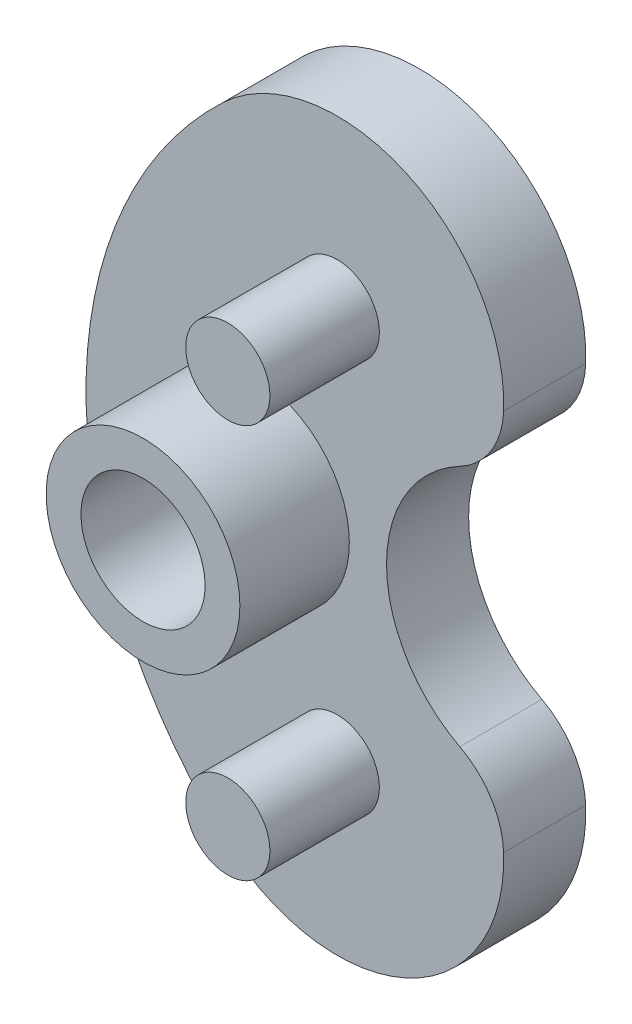
ISO-10303-21;
HEADER;
FILE_DESCRIPTION(('STEP AP214'),'2;1');
FILE_NAME('part.step','',(''),(''),'','','');
FILE_SCHEMA(('AUTOMOTIVE_DESIGN { 1 0 10303 214 1 1 1 1 }'));
ENDSEC;
DATA;
#1=APPLICATION_CONTEXT('core data for automotive mechanical design processes');
#2=APPLICATION_PROTOCOL_DEFINITION('international standard','automotive_design',2000,#1);
#3=PRODUCT_CONTEXT('',#1,'mechanical');
#4=PRODUCT('Part','Part','',(#3));
#5=PRODUCT_RELATED_PRODUCT_CATEGORY('part','',(#4));
#6=PRODUCT_DEFINITION_FORMATION('','',#4);
#7=PRODUCT_DEFINITION_CONTEXT('part definition',#1,'design');
#8=PRODUCT_DEFINITION('design','',#6,#7);
#9=PRODUCT_DEFINITION_SHAPE('','',#8);
#10=(LENGTH_UNIT() NAMED_UNIT(*) SI_UNIT(.MILLI.,.METRE.));
#11=(NAMED_UNIT(*) PLANE_ANGLE_UNIT() SI_UNIT($,.RADIAN.));
#12=(NAMED_UNIT(*) SI_UNIT($,.STERADIAN.) SOLID_ANGLE_UNIT());
#13=UNCERTAINTY_MEASURE_WITH_UNIT(LENGTH_MEASURE(1.E-05),#10,'distance_accuracy_value','');
#14=(GEOMETRIC_REPRESENTATION_CONTEXT(3) GLOBAL_UNCERTAINTY_ASSIGNED_CONTEXT((#13)) GLOBAL_UNIT_ASSIGNED_CONTEXT((#10,
#11,#12)) REPRESENTATION_CONTEXT('',''));
#15=CARTESIAN_POINT('',(0.,0.,0.));
#16=DIRECTION('',(0.,0.,1.));
#17=DIRECTION('',(1.,0.,0.));
#18=AXIS2_PLACEMENT_3D('',#15,#16,#17);
#19=CARTESIAN_POINT('',(-9.91665428511723,0.,0.999999999999997));
#20=DIRECTION('',(0.,0.,-1.));
#21=DIRECTION('',(-1.,0.,0.));
#22=AXIS2_PLACEMENT_3D('',#19,#20,#21);
#23=CYLINDRICAL_SURFACE('',#22,2.26880471802471);
#24=CARTESIAN_POINT('',(-9.91665428511723,0.,-21.745));
#25=DIRECTION('',(0.,0.,-1.));
#26=DIRECTION('',(-1.,0.,0.));
#27=AXIS2_PLACEMENT_3D('',#24,#25,#26);
#28=CIRCLE('',#27,2.26880471802471);
#29=CARTESIAN_POINT('',(-12.1854590031419,0.,-21.745));
#30=VERTEX_POINT('',#29);
#31=EDGE_CURVE('E143',#30,#30,#28,.T.);
#32=ORIENTED_EDGE('',*,*,#31,.T.);
#33=EDGE_LOOP('',(#32));
#34=FACE_BOUND('',#33,.T.);
#35=CARTESIAN_POINT('',(-9.91665428511723,0.,-14.745));
#36=DIRECTION('',(0.,0.,1.));
#37=DIRECTION('',(1.,0.,0.));
#38=AXIS2_PLACEMENT_3D('',#35,#36,#37);
#39=CIRCLE('',#38,2.26880471802471);
#40=CARTESIAN_POINT('',(-7.64784956709252,0.,-14.745));
#41=VERTEX_POINT('',#40);
#42=EDGE_CURVE('E129',#41,#41,#39,.F.);
#43=ORIENTED_EDGE('',*,*,#42,.F.);
#44=EDGE_LOOP('',(#43));
#45=FACE_BOUND('',#44,.T.);
#46=ADVANCED_FACE('F35',(#34,#45),#23,.F.);
#47=CARTESIAN_POINT('',(-6.81696153884559,-7.20201829964587,-21.745));
#48=DIRECTION('',(0.,0.,1.));
#49=DIRECTION('',(1.,0.,0.));
#50=AXIS2_PLACEMENT_3D('',#47,#48,#49);
#51=CYLINDRICAL_SURFACE('',#50,1.53885172207011);
#52=CARTESIAN_POINT('',(-6.81696153884559,-7.20201829964587,-18.745));
#53=DIRECTION('',(0.,0.,-1.));
#54=DIRECTION('',(-1.,0.,0.));
#55=AXIS2_PLACEMENT_3D('',#52,#53,#54);
#56=CIRCLE('',#55,1.53885172207011);
#57=CARTESIAN_POINT('',(-8.3558132609157,-7.20201829964587,-18.745));
#58=VERTEX_POINT('',#57);
#59=EDGE_CURVE('E150',#58,#58,#56,.T.);
#60=ORIENTED_EDGE('',*,*,#59,.F.);
#61=EDGE_LOOP('',(#60));
#62=FACE_BOUND('',#61,.T.);
#63=CARTESIAN_POINT('',(-6.81696153884559,-7.20201829964587,-14.745));
#64=DIRECTION('',(0.,0.,1.));
#65=DIRECTION('',(1.,0.,0.));
#66=AXIS2_PLACEMENT_3D('',#63,#64,#65);
#67=CIRCLE('',#66,1.53885172207011);
#68=CARTESIAN_POINT('',(-5.27810981677548,-7.20201829964587,-14.745));
#69=VERTEX_POINT('',#68);
#70=EDGE_CURVE('E164',#69,#69,#67,.T.);
#71=ORIENTED_EDGE('',*,*,#70,.F.);
#72=EDGE_LOOP('',(#71));
#73=FACE_BOUND('',#72,.T.);
#74=ADVANCED_FACE('F157',(#62,#73),#51,.T.);
#75=CARTESIAN_POINT('',(-9.91665428511723,0.,-21.745));
#76=DIRECTION('',(0.,0.,1.));
#77=DIRECTION('',(1.,0.,0.));
#78=AXIS2_PLACEMENT_3D('',#75,#76,#77);
#79=CYLINDRICAL_SURFACE('',#78,3.54083599682753);
#80=CARTESIAN_POINT('',(-9.91665428511723,0.,-18.745));
#81=DIRECTION('',(0.,0.,-1.));
#82=DIRECTION('',(-1.,0.,0.));
#83=AXIS2_PLACEMENT_3D('',#80,#81,#82);
#84=CIRCLE('',#83,3.54083599682753);
#85=CARTESIAN_POINT('',(-13.4574902819448,0.,-18.745));
#86=VERTEX_POINT('',#85);
#87=EDGE_CURVE('E11',#86,#86,#84,.T.);
#88=ORIENTED_EDGE('',*,*,#87,.F.);
#89=EDGE_LOOP('',(#88));
#90=FACE_BOUND('',#89,.T.);
#91=CARTESIAN_POINT('',(-9.91665428511723,0.,-14.745));
#92=DIRECTION('',(0.,0.,1.));
#93=DIRECTION('',(1.,0.,0.));
#94=AXIS2_PLACEMENT_3D('',#91,#92,#93);
#95=CIRCLE('',#94,3.54083599682753);
#96=CARTESIAN_POINT('',(-6.3758182882897,0.,-14.745));
#97=VERTEX_POINT('',#96);
#98=EDGE_CURVE('E166',#97,#97,#95,.T.);
#99=ORIENTED_EDGE('',*,*,#98,.F.);
#100=EDGE_LOOP('',(#99));
#101=FACE_BOUND('',#100,.T.);
#102=ADVANCED_FACE('F160',(#90,#101),#79,.T.);
#103=CARTESIAN_POINT('',(-6.81696153884559,7.20201829964587,-21.745));
#104=DIRECTION('',(0.,0.,1.));
#105=DIRECTION('',(1.,0.,0.));
#106=AXIS2_PLACEMENT_3D('',#103,#104,#105);
#107=CYLINDRICAL_SURFACE('',#106,1.53885172207011);
#108=CARTESIAN_POINT('',(-6.81696153884559,7.20201829964587,-18.745));
#109=DIRECTION('',(0.,0.,-1.));
#110=DIRECTION('',(-1.,0.,0.));
#111=AXIS2_PLACEMENT_3D('',#108,#109,#110);
#112=CIRCLE('',#111,1.53885172207011);
#113=CARTESIAN_POINT('',(-8.3558132609157,7.20201829964587,-18.745));
#114=VERTEX_POINT('',#113);
#115=EDGE_CURVE('E44',#114,#114,#112,.T.);
#116=ORIENTED_EDGE('',*,*,#115,.F.);
#117=EDGE_LOOP('',(#116));
#118=FACE_BOUND('',#117,.T.);
#119=CARTESIAN_POINT('',(-6.81696153884559,7.20201829964587,-14.745));
#120=DIRECTION('',(0.,0.,1.));
#121=DIRECTION('',(1.,0.,0.));
#122=AXIS2_PLACEMENT_3D('',#119,#120,#121);
#123=CIRCLE('',#122,1.53885172207011);
#124=CARTESIAN_POINT('',(-5.27810981677548,7.20201829964587,-14.745));
#125=VERTEX_POINT('',#124);
#126=EDGE_CURVE('E38',#125,#125,#123,.T.);
#127=ORIENTED_EDGE('',*,*,#126,.F.);
#128=EDGE_LOOP('',(#127));
#129=FACE_BOUND('',#128,.T.);
#130=ADVANCED_FACE('F180',(#118,#129),#107,.T.);
#131=CARTESIAN_POINT('',(-3.73554540133623,-7.09295233344732,-18.745));
#132=DIRECTION('',(0.,0.,-1.));
#133=DIRECTION('',(-1.,0.,0.));
#134=AXIS2_PLACEMENT_3D('',#131,#132,#133);
#135=CYLINDRICAL_SURFACE('',#134,3.);
#136=CARTESIAN_POINT('',(-3.73554540133623,-7.09295233344732,-21.745));
#137=DIRECTION('',(0.,0.,-1.));
#138=DIRECTION('',(1.,0.,0.));
#139=AXIS2_PLACEMENT_3D('',#136,#137,#138);
#140=CIRCLE('',#139,3.);
#141=CARTESIAN_POINT('',(-2.33759913999915,-4.43856987223083,-21.745));
#142=VERTEX_POINT('',#141);
#143=CARTESIAN_POINT('',(-0.737422820430779,-6.98683452219563,-21.745));
#144=VERTEX_POINT('',#143);
#145=EDGE_CURVE('E138',#142,#144,#140,.T.);
#146=ORIENTED_EDGE('',*,*,#145,.F.);
#147=DIRECTION('',(0.,0.,-1.));
#148=VECTOR('',#147,1.);
#149=CARTESIAN_POINT('',(-2.33759913999915,-4.43856987223083,-18.745));
#150=LINE('',#149,#148);
#151=CARTESIAN_POINT('',(-2.33759913999915,-4.43856987223083,-18.745));
#152=VERTEX_POINT('',#151);
#153=EDGE_CURVE('E76',#152,#142,#150,.T.);
#154=ORIENTED_EDGE('',*,*,#153,.F.);
#155=CARTESIAN_POINT('',(-3.73554540133623,-7.09295233344732,-18.745));
#156=DIRECTION('',(0.,0.,-1.));
#157=DIRECTION('',(1.,0.,0.));
#158=AXIS2_PLACEMENT_3D('',#155,#156,#157);
#159=CIRCLE('',#158,3.);
#160=CARTESIAN_POINT('',(-0.737422820430779,-6.98683452219563,-18.745));
#161=VERTEX_POINT('',#160);
#162=EDGE_CURVE('E115',#152,#161,#159,.T.);
#163=ORIENTED_EDGE('',*,*,#162,.T.);
#164=DIRECTION('',(0.,0.,-1.));
#165=VECTOR('',#164,1.);
#166=CARTESIAN_POINT('',(-0.737422820430779,-6.98683452219563,-18.745));
#167=LINE('',#166,#165);
#168=EDGE_CURVE('E53',#161,#144,#167,.T.);
#169=ORIENTED_EDGE('',*,*,#168,.T.);
#170=EDGE_LOOP('',(#146,#154,#163,#169));
#171=FACE_BOUND('',#170,.T.);
#172=ADVANCED_FACE('F178',(#171),#135,.T.);
#173=CARTESIAN_POINT('',(0.,0.,-18.745));
#174=DIRECTION('',(0.,0.,-1.));
#175=DIRECTION('',(-1.,0.,0.));
#176=AXIS2_PLACEMENT_3D('',#173,#174,#175);
#177=CYLINDRICAL_SURFACE('',#176,5.0165);
#178=CARTESIAN_POINT('',(0.,0.,-21.745));
#179=DIRECTION('',(0.,0.,1.));
#180=DIRECTION('',(-1.,0.,0.));
#181=AXIS2_PLACEMENT_3D('',#178,#179,#180);
#182=CIRCLE('',#181,5.0165);
#183=CARTESIAN_POINT('',(-2.33759913999915,4.43856987223084,-21.745));
#184=VERTEX_POINT('',#183);
#185=EDGE_CURVE('E101',#184,#142,#182,.T.);
#186=ORIENTED_EDGE('',*,*,#185,.F.);
#187=DIRECTION('',(0.,0.,-1.));
#188=VECTOR('',#187,1.);
#189=CARTESIAN_POINT('',(-2.33759913999915,4.43856987223084,-18.745));
#190=LINE('',#189,#188);
#191=CARTESIAN_POINT('',(-2.33759913999915,4.43856987223084,-18.745));
#192=VERTEX_POINT('',#191);
#193=EDGE_CURVE('E96',#192,#184,#190,.T.);
#194=ORIENTED_EDGE('',*,*,#193,.F.);
#195=CARTESIAN_POINT('',(0.,0.,-18.745));
#196=DIRECTION('',(0.,0.,1.));
#197=DIRECTION('',(-1.,0.,0.));
#198=AXIS2_PLACEMENT_3D('',#195,#196,#197);
#199=CIRCLE('',#198,5.0165);
#200=EDGE_CURVE('E99',#192,#152,#199,.T.);
#201=ORIENTED_EDGE('',*,*,#200,.T.);
#202=ORIENTED_EDGE('',*,*,#153,.T.);
#203=EDGE_LOOP('',(#186,#194,#201,#202));
#204=FACE_BOUND('',#203,.T.);
#205=ADVANCED_FACE('F98',(#204),#177,.F.);
#206=CARTESIAN_POINT('',(-3.73554540133623,7.09295233344732,-18.745));
#207=DIRECTION('',(0.,0.,-1.));
#208=DIRECTION('',(-1.,0.,0.));
#209=AXIS2_PLACEMENT_3D('',#206,#207,#208);
#210=CYLINDRICAL_SURFACE('',#209,3.);
#211=CARTESIAN_POINT('',(-3.73554540133623,7.09295233344732,-21.745));
#212=DIRECTION('',(0.,0.,-1.));
#213=DIRECTION('',(-1.,0.,0.));
#214=AXIS2_PLACEMENT_3D('',#211,#212,#213);
#215=CIRCLE('',#214,3.);
#216=CARTESIAN_POINT('',(-0.737422820430777,6.98683452219563,-21.745));
#217=VERTEX_POINT('',#216);
#218=EDGE_CURVE('E135',#217,#184,#215,.T.);
#219=ORIENTED_EDGE('',*,*,#218,.F.);
#220=DIRECTION('',(0.,0.,-1.));
#221=VECTOR('',#220,1.);
#222=CARTESIAN_POINT('',(-0.737422820430777,6.98683452219563,-18.745));
#223=LINE('',#222,#221);
#224=CARTESIAN_POINT('',(-0.737422820430777,6.98683452219563,-18.745));
#225=VERTEX_POINT('',#224);
#226=EDGE_CURVE('E106',#225,#217,#223,.T.);
#227=ORIENTED_EDGE('',*,*,#226,.F.);
#228=CARTESIAN_POINT('',(-3.73554540133623,7.09295233344732,-18.745));
#229=DIRECTION('',(0.,0.,-1.));
#230=DIRECTION('',(-1.,0.,0.));
#231=AXIS2_PLACEMENT_3D('',#228,#229,#230);
#232=CIRCLE('',#231,3.);
#233=EDGE_CURVE('E113',#225,#192,#232,.T.);
#234=ORIENTED_EDGE('',*,*,#233,.T.);
#235=ORIENTED_EDGE('',*,*,#193,.T.);
#236=EDGE_LOOP('',(#219,#227,#234,#235));
#237=FACE_BOUND('',#236,.T.);
#238=ADVANCED_FACE('F117',(#237),#210,.T.);
#239=CARTESIAN_POINT('',(-6.81696153884559,7.20201829964587,-18.745));
#240=DIRECTION('',(0.,0.,-1.));
#241=DIRECTION('',(-1.,0.,0.));
#242=AXIS2_PLACEMENT_3D('',#239,#240,#241);
#243=CYLINDRICAL_SURFACE('',#242,6.08334571488277);
#244=CARTESIAN_POINT('',(-6.81696153884559,7.20201829964587,-21.745));
#245=DIRECTION('',(0.,0.,-1.));
#246=DIRECTION('',(1.,0.,0.));
#247=AXIS2_PLACEMENT_3D('',#244,#245,#246);
#248=CIRCLE('',#247,6.08334571488277);
#249=CARTESIAN_POINT('',(-10.9988088205537,11.620077647284,-21.745));
#250=VERTEX_POINT('',#249);
#251=EDGE_CURVE('E132',#250,#217,#248,.T.);
#252=ORIENTED_EDGE('',*,*,#251,.F.);
#253=DIRECTION('',(0.,0.,-1.));
#254=VECTOR('',#253,1.);
#255=CARTESIAN_POINT('',(-10.9988088205537,11.620077647284,-18.745));
#256=LINE('',#255,#254);
#257=CARTESIAN_POINT('',(-10.9988088205537,11.620077647284,-18.745));
#258=VERTEX_POINT('',#257);
#259=EDGE_CURVE('E146',#258,#250,#256,.T.);
#260=ORIENTED_EDGE('',*,*,#259,.F.);
#261=CARTESIAN_POINT('',(-6.81696153884559,7.20201829964587,-18.745));
#262=DIRECTION('',(0.,0.,-1.));
#263=DIRECTION('',(1.,0.,0.));
#264=AXIS2_PLACEMENT_3D('',#261,#262,#263);
#265=CIRCLE('',#264,6.08334571488277);
#266=EDGE_CURVE('E118',#258,#225,#265,.T.);
#267=ORIENTED_EDGE('',*,*,#266,.T.);
#268=ORIENTED_EDGE('',*,*,#226,.T.);
#269=EDGE_LOOP('',(#252,#260,#267,#268));
#270=FACE_BOUND('',#269,.T.);
#271=ADVANCED_FACE('F309',(#270),#243,.T.);
#272=CARTESIAN_POINT('',(0.,0.,-18.745));
#273=DIRECTION('',(0.,0.,-1.));
#274=DIRECTION('',(-1.,0.,0.));
#275=AXIS2_PLACEMENT_3D('',#272,#273,#274);
#276=CYLINDRICAL_SURFACE('',#275,16.);
#277=CARTESIAN_POINT('',(0.,0.,-21.745));
#278=DIRECTION('',(0.,0.,-1.));
#279=DIRECTION('',(-1.,0.,0.));
#280=AXIS2_PLACEMENT_3D('',#277,#278,#279);
#281=CIRCLE('',#280,16.);
#282=CARTESIAN_POINT('',(-10.9988088205537,-11.620077647284,-21.745));
#283=VERTEX_POINT('',#282);
#284=EDGE_CURVE('E128',#283,#250,#281,.T.);
#285=ORIENTED_EDGE('',*,*,#284,.F.);
#286=DIRECTION('',(0.,0.,-1.));
#287=VECTOR('',#286,1.);
#288=CARTESIAN_POINT('',(-10.9988088205537,-11.620077647284,-18.745));
#289=LINE('',#288,#287);
#290=CARTESIAN_POINT('',(-10.9988088205537,-11.620077647284,-18.745));
#291=VERTEX_POINT('',#290);
#292=EDGE_CURVE('E88',#291,#283,#289,.T.);
#293=ORIENTED_EDGE('',*,*,#292,.F.);
#294=CARTESIAN_POINT('',(0.,0.,-18.745));
#295=DIRECTION('',(0.,0.,-1.));
#296=DIRECTION('',(-1.,0.,0.));
#297=AXIS2_PLACEMENT_3D('',#294,#295,#296);
#298=CIRCLE('',#297,16.);
#299=EDGE_CURVE('E120',#291,#258,#298,.T.);
#300=ORIENTED_EDGE('',*,*,#299,.T.);
#301=ORIENTED_EDGE('',*,*,#259,.T.);
#302=EDGE_LOOP('',(#285,#293,#300,#301));
#303=FACE_BOUND('',#302,.T.);
#304=ADVANCED_FACE('F173',(#303),#276,.T.);
#305=CARTESIAN_POINT('',(-6.81696153884559,-7.20201829964587,-18.745));
#306=DIRECTION('',(0.,0.,-1.));
#307=DIRECTION('',(-1.,0.,0.));
#308=AXIS2_PLACEMENT_3D('',#305,#306,#307);
#309=CYLINDRICAL_SURFACE('',#308,6.08334571488277);
#310=CARTESIAN_POINT('',(-6.81696153884559,-7.20201829964587,-21.745));
#311=DIRECTION('',(0.,0.,-1.));
#312=DIRECTION('',(-1.,0.,0.));
#313=AXIS2_PLACEMENT_3D('',#310,#311,#312);
#314=CIRCLE('',#313,6.08334571488277);
#315=EDGE_CURVE('E125',#144,#283,#314,.T.);
#316=ORIENTED_EDGE('',*,*,#315,.F.);
#317=ORIENTED_EDGE('',*,*,#168,.F.);
#318=CARTESIAN_POINT('',(-6.81696153884559,-7.20201829964587,-18.745));
#319=DIRECTION('',(0.,0.,-1.));
#320=DIRECTION('',(-1.,0.,0.));
#321=AXIS2_PLACEMENT_3D('',#318,#319,#320);
#322=CIRCLE('',#321,6.08334571488277);
#323=EDGE_CURVE('E141',#161,#291,#322,.T.);
#324=ORIENTED_EDGE('',*,*,#323,.T.);
#325=ORIENTED_EDGE('',*,*,#292,.T.);
#326=EDGE_LOOP('',(#316,#317,#324,#325));
#327=FACE_BOUND('',#326,.T.);
#328=ADVANCED_FACE('F175',(#327),#309,.T.);
#329=CARTESIAN_POINT('',(-9.91665428511723,0.,-21.745));
#330=DIRECTION('',(0.,0.,-1.));
#331=DIRECTION('',(-1.,0.,0.));
#332=AXIS2_PLACEMENT_3D('',#329,#330,#331);
#333=PLANE('',#332);
#334=ORIENTED_EDGE('',*,*,#31,.F.);
#335=EDGE_LOOP('',(#334));
#336=FACE_BOUND('',#335,.T.);
#337=ORIENTED_EDGE('',*,*,#315,.T.);
#338=ORIENTED_EDGE('',*,*,#284,.T.);
#339=ORIENTED_EDGE('',*,*,#251,.T.);
#340=ORIENTED_EDGE('',*,*,#218,.T.);
#341=ORIENTED_EDGE('',*,*,#185,.T.);
#342=ORIENTED_EDGE('',*,*,#145,.T.);
#343=EDGE_LOOP('',(#337,#338,#339,#340,#341,#342));
#344=FACE_BOUND('',#343,.T.);
#345=ADVANCED_FACE('F177',(#336,#344),#333,.T.);
#346=CARTESIAN_POINT('',(-3.40848076942279,-3.60100914982293,-18.745));
#347=DIRECTION('',(0.,0.,-1.));
#348=DIRECTION('',(-1.,0.,0.));
#349=AXIS2_PLACEMENT_3D('',#346,#347,#348);
#350=PLANE('',#349);
#351=ORIENTED_EDGE('',*,*,#115,.T.);
#352=EDGE_LOOP('',(#351));
#353=FACE_BOUND('',#352,.T.);
#354=ORIENTED_EDGE('',*,*,#323,.F.);
#355=ORIENTED_EDGE('',*,*,#162,.F.);
#356=ORIENTED_EDGE('',*,*,#200,.F.);
#357=ORIENTED_EDGE('',*,*,#233,.F.);
#358=ORIENTED_EDGE('',*,*,#266,.F.);
#359=ORIENTED_EDGE('',*,*,#299,.F.);
#360=EDGE_LOOP('',(#354,#355,#356,#357,#358,#359));
#361=FACE_BOUND('',#360,.T.);
#362=ORIENTED_EDGE('',*,*,#59,.T.);
#363=EDGE_LOOP('',(#362));
#364=FACE_BOUND('',#363,.T.);
#365=ORIENTED_EDGE('',*,*,#87,.T.);
#366=EDGE_LOOP('',(#365));
#367=FACE_BOUND('',#366,.T.);
#368=ADVANCED_FACE('F110',(#353,#361,#364,#367),#350,.F.);
#369=CARTESIAN_POINT('',(0.,0.,-14.745));
#370=DIRECTION('',(0.,0.,1.));
#371=DIRECTION('',(1.,0.,0.));
#372=AXIS2_PLACEMENT_3D('',#369,#370,#371);
#373=PLANE('',#372);
#374=ORIENTED_EDGE('',*,*,#126,.T.);
#375=EDGE_LOOP('',(#374));
#376=FACE_BOUND('',#375,.T.);
#377=ADVANCED_FACE('F182',(#376),#373,.T.);
#378=ORIENTED_EDGE('',*,*,#98,.T.);
#379=EDGE_LOOP('',(#378));
#380=FACE_BOUND('',#379,.T.);
#381=ORIENTED_EDGE('',*,*,#42,.T.);
#382=EDGE_LOOP('',(#381));
#383=FACE_BOUND('',#382,.T.);
#384=ADVANCED_FACE('F192',(#380,#383),#373,.T.);
#385=ORIENTED_EDGE('',*,*,#70,.T.);
#386=EDGE_LOOP('',(#385));
#387=FACE_BOUND('',#386,.T.);
#388=ADVANCED_FACE('F195',(#387),#373,.T.);
#389=CLOSED_SHELL('',(#46,#74,#102,#130,#172,#205,#238,#271,#304,#328,#345,#368,#377,#384,#388));
#390=MANIFOLD_SOLID_BREP('B2',#389);
#391=ADVANCED_BREP_SHAPE_REPRESENTATION('',(#18,#390),#14);
#392=SHAPE_DEFINITION_REPRESENTATION(#9,#391);
ENDSEC;
END-ISO-10303-21;
